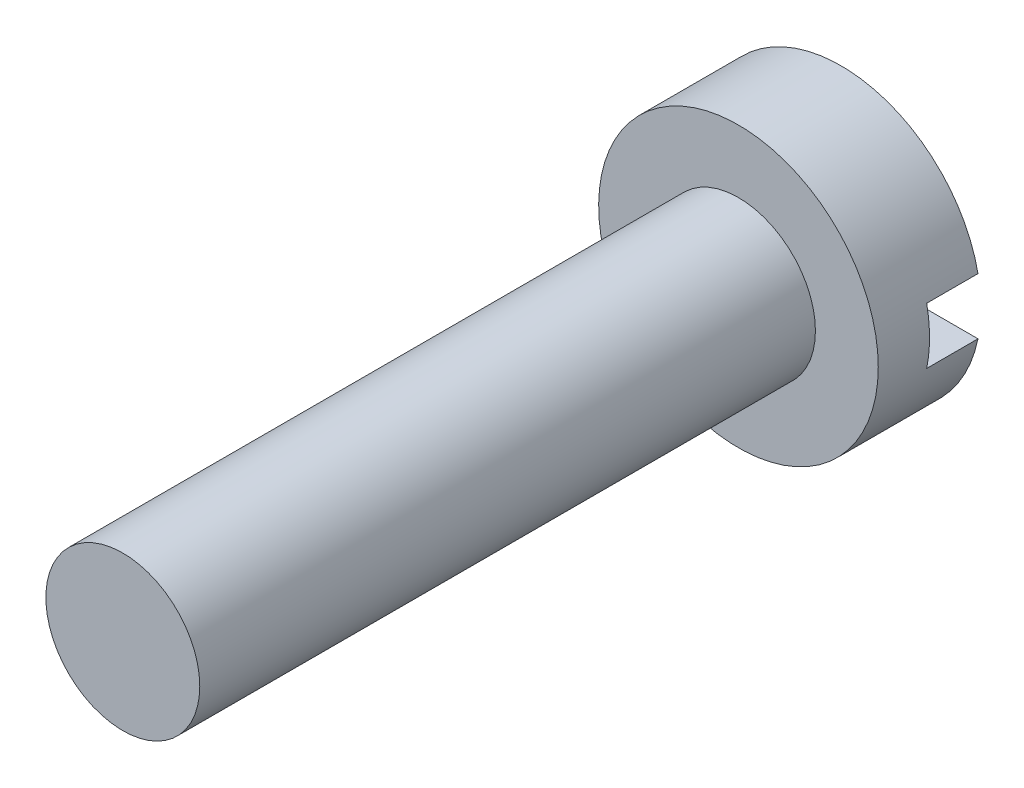
ISO-10303-21;
HEADER;
FILE_DESCRIPTION(('STEP AP214'),'2;1');
FILE_NAME('part.step','',(''),(''),'','','');
FILE_SCHEMA(('AUTOMOTIVE_DESIGN { 1 0 10303 214 1 1 1 1 }'));
ENDSEC;
DATA;
#1=APPLICATION_CONTEXT('core data for automotive mechanical design processes');
#2=APPLICATION_PROTOCOL_DEFINITION('international standard','automotive_design',2000,#1);
#3=PRODUCT_CONTEXT('',#1,'mechanical');
#4=PRODUCT('Part','Part','',(#3));
#5=PRODUCT_RELATED_PRODUCT_CATEGORY('part','',(#4));
#6=PRODUCT_DEFINITION_FORMATION('','',#4);
#7=PRODUCT_DEFINITION_CONTEXT('part definition',#1,'design');
#8=PRODUCT_DEFINITION('design','',#6,#7);
#9=PRODUCT_DEFINITION_SHAPE('','',#8);
#10=(LENGTH_UNIT() NAMED_UNIT(*) SI_UNIT(.MILLI.,.METRE.));
#11=(NAMED_UNIT(*) PLANE_ANGLE_UNIT() SI_UNIT($,.RADIAN.));
#12=(NAMED_UNIT(*) SI_UNIT($,.STERADIAN.) SOLID_ANGLE_UNIT());
#13=UNCERTAINTY_MEASURE_WITH_UNIT(LENGTH_MEASURE(1.E-05),#10,'distance_accuracy_value','');
#14=(GEOMETRIC_REPRESENTATION_CONTEXT(3) GLOBAL_UNCERTAINTY_ASSIGNED_CONTEXT((#13)) GLOBAL_UNIT_ASSIGNED_CONTEXT((#10,
#11,#12)) REPRESENTATION_CONTEXT('',''));
#15=CARTESIAN_POINT('',(0.,0.,0.));
#16=DIRECTION('',(0.,0.,1.));
#17=DIRECTION('',(1.,0.,0.));
#18=AXIS2_PLACEMENT_3D('',#15,#16,#17);
#19=CARTESIAN_POINT('',(0.,0.,2.));
#20=DIRECTION('',(0.,0.,1.));
#21=DIRECTION('',(1.,0.,0.));
#22=AXIS2_PLACEMENT_3D('',#19,#20,#21);
#23=PLANE('',#22);
#24=CARTESIAN_POINT('',(0.,0.,2.));
#25=DIRECTION('',(0.,0.,1.));
#26=DIRECTION('',(1.,0.,0.));
#27=AXIS2_PLACEMENT_3D('',#24,#25,#26);
#28=CIRCLE('',#27,2.725);
#29=CARTESIAN_POINT('',(2.725,0.,2.));
#30=VERTEX_POINT('',#29);
#31=EDGE_CURVE('E77',#30,#30,#28,.T.);
#32=ORIENTED_EDGE('',*,*,#31,.T.);
#33=EDGE_LOOP('',(#32));
#34=FACE_BOUND('',#33,.T.);
#35=CARTESIAN_POINT('',(0.,0.,2.));
#36=DIRECTION('',(0.,0.,1.));
#37=DIRECTION('',(1.,0.,0.));
#38=AXIS2_PLACEMENT_3D('',#35,#36,#37);
#39=CIRCLE('',#38,1.5);
#40=CARTESIAN_POINT('',(1.5,0.,2.));
#41=VERTEX_POINT('',#40);
#42=EDGE_CURVE('E143',#41,#41,#39,.T.);
#43=ORIENTED_EDGE('',*,*,#42,.F.);
#44=EDGE_LOOP('',(#43));
#45=FACE_BOUND('',#44,.T.);
#46=ADVANCED_FACE('F29',(#34,#45),#23,.T.);
#47=CARTESIAN_POINT('',(0.,0.,0.));
#48=DIRECTION('',(0.,0.,1.));
#49=DIRECTION('',(1.,0.,0.));
#50=AXIS2_PLACEMENT_3D('',#47,#48,#49);
#51=PLANE('',#50);
#52=CARTESIAN_POINT('',(0.,0.,0.));
#53=DIRECTION('',(0.,0.,1.));
#54=DIRECTION('',(1.,0.,0.));
#55=AXIS2_PLACEMENT_3D('',#52,#53,#54);
#56=CIRCLE('',#55,2.725);
#57=CARTESIAN_POINT('',(-2.66891832021889,-0.55,0.));
#58=VERTEX_POINT('',#57);
#59=CARTESIAN_POINT('',(2.66891832021889,-0.55,0.));
#60=VERTEX_POINT('',#59);
#61=EDGE_CURVE('E88',#58,#60,#56,.T.);
#62=ORIENTED_EDGE('',*,*,#61,.F.);
#63=DIRECTION('',(1.,0.,0.));
#64=VECTOR('',#63,1.);
#65=CARTESIAN_POINT('',(0.,-0.55,0.));
#66=LINE('',#65,#64);
#67=EDGE_CURVE('E76',#58,#60,#66,.T.);
#68=ORIENTED_EDGE('',*,*,#67,.T.);
#69=EDGE_LOOP('',(#62,#68));
#70=FACE_BOUND('',#69,.T.);
#71=ADVANCED_FACE('F106',(#70),#51,.F.);
#72=CARTESIAN_POINT('',(0.,0.,2.));
#73=DIRECTION('',(0.,0.,-1.));
#74=DIRECTION('',(-1.,0.,0.));
#75=AXIS2_PLACEMENT_3D('',#72,#73,#74);
#76=CYLINDRICAL_SURFACE('',#75,2.725);
#77=ORIENTED_EDGE('',*,*,#61,.T.);
#78=DIRECTION('',(0.,0.,-1.));
#79=VECTOR('',#78,1.);
#80=CARTESIAN_POINT('',(2.66891832021889,-0.55,2.));
#81=LINE('',#80,#79);
#82=CARTESIAN_POINT('',(2.66891832021889,-0.55,1.));
#83=VERTEX_POINT('',#82);
#84=EDGE_CURVE('E85',#60,#83,#81,.F.);
#85=ORIENTED_EDGE('',*,*,#84,.T.);
#86=CARTESIAN_POINT('',(0.,0.,1.));
#87=DIRECTION('',(0.,0.,-1.));
#88=DIRECTION('',(-1.,0.,0.));
#89=AXIS2_PLACEMENT_3D('',#86,#87,#88);
#90=CIRCLE('',#89,2.725);
#91=CARTESIAN_POINT('',(2.66891832021889,0.55,1.));
#92=VERTEX_POINT('',#91);
#93=EDGE_CURVE('E11',#92,#83,#90,.T.);
#94=ORIENTED_EDGE('',*,*,#93,.F.);
#95=DIRECTION('',(0.,0.,-1.));
#96=VECTOR('',#95,1.);
#97=CARTESIAN_POINT('',(2.66891832021889,0.55,2.));
#98=LINE('',#97,#96);
#99=CARTESIAN_POINT('',(2.66891832021889,0.55,0.));
#100=VERTEX_POINT('',#99);
#101=EDGE_CURVE('E71',#92,#100,#98,.T.);
#102=ORIENTED_EDGE('',*,*,#101,.T.);
#103=CARTESIAN_POINT('',(-2.66891832021889,0.55,0.));
#104=VERTEX_POINT('',#103);
#105=EDGE_CURVE('E83',#100,#104,#56,.T.);
#106=ORIENTED_EDGE('',*,*,#105,.T.);
#107=DIRECTION('',(0.,0.,-1.));
#108=VECTOR('',#107,1.);
#109=CARTESIAN_POINT('',(-2.66891832021889,0.55,2.));
#110=LINE('',#109,#108);
#111=CARTESIAN_POINT('',(-2.66891832021889,0.55,1.));
#112=VERTEX_POINT('',#111);
#113=EDGE_CURVE('E44',#104,#112,#110,.F.);
#114=ORIENTED_EDGE('',*,*,#113,.T.);
#115=CARTESIAN_POINT('',(-2.66891832021889,-0.55,1.));
#116=VERTEX_POINT('',#115);
#117=EDGE_CURVE('E33',#116,#112,#90,.T.);
#118=ORIENTED_EDGE('',*,*,#117,.F.);
#119=DIRECTION('',(0.,0.,-1.));
#120=VECTOR('',#119,1.);
#121=CARTESIAN_POINT('',(-2.66891832021889,-0.55,2.));
#122=LINE('',#121,#120);
#123=EDGE_CURVE('E52',#116,#58,#122,.T.);
#124=ORIENTED_EDGE('',*,*,#123,.T.);
#125=EDGE_LOOP('',(#77,#85,#94,#102,#106,#114,#118,#124));
#126=FACE_BOUND('',#125,.T.);
#127=ORIENTED_EDGE('',*,*,#31,.F.);
#128=EDGE_LOOP('',(#127));
#129=FACE_BOUND('',#128,.T.);
#130=ADVANCED_FACE('F31',(#126,#129),#76,.T.);
#131=ORIENTED_EDGE('',*,*,#105,.F.);
#132=DIRECTION('',(-1.,0.,0.));
#133=VECTOR('',#132,1.);
#134=CARTESIAN_POINT('',(0.,0.55,0.));
#135=LINE('',#134,#133);
#136=EDGE_CURVE('E68',#100,#104,#135,.T.);
#137=ORIENTED_EDGE('',*,*,#136,.T.);
#138=EDGE_LOOP('',(#131,#137));
#139=FACE_BOUND('',#138,.T.);
#140=ADVANCED_FACE('F87',(#139),#51,.F.);
#141=CARTESIAN_POINT('',(-3.44980190887808,0.55,1.));
#142=DIRECTION('',(0.,0.,-1.));
#143=DIRECTION('',(-1.,0.,0.));
#144=AXIS2_PLACEMENT_3D('',#141,#142,#143);
#145=PLANE('',#144);
#146=ORIENTED_EDGE('',*,*,#93,.T.);
#147=DIRECTION('',(-1.,0.,0.));
#148=VECTOR('',#147,1.);
#149=CARTESIAN_POINT('',(3.90126958400864,-0.55,1.));
#150=LINE('',#149,#148);
#151=EDGE_CURVE('E101',#83,#116,#150,.T.);
#152=ORIENTED_EDGE('',*,*,#151,.T.);
#153=ORIENTED_EDGE('',*,*,#117,.T.);
#154=DIRECTION('',(1.,0.,0.));
#155=VECTOR('',#154,1.);
#156=CARTESIAN_POINT('',(-3.44980190887808,0.55,1.));
#157=LINE('',#156,#155);
#158=EDGE_CURVE('E100',#112,#92,#157,.T.);
#159=ORIENTED_EDGE('',*,*,#158,.T.);
#160=EDGE_LOOP('',(#146,#152,#153,#159));
#161=FACE_BOUND('',#160,.T.);
#162=ADVANCED_FACE('F99',(#161),#145,.T.);
#163=CARTESIAN_POINT('',(3.90126958400864,-0.55,1.));
#164=DIRECTION('',(0.,-1.,0.));
#165=DIRECTION('',(0.,0.,-1.));
#166=AXIS2_PLACEMENT_3D('',#163,#164,#165);
#167=PLANE('',#166);
#168=ORIENTED_EDGE('',*,*,#151,.F.);
#169=ORIENTED_EDGE('',*,*,#84,.F.);
#170=ORIENTED_EDGE('',*,*,#67,.F.);
#171=ORIENTED_EDGE('',*,*,#123,.F.);
#172=EDGE_LOOP('',(#168,#169,#170,#171));
#173=FACE_BOUND('',#172,.T.);
#174=ADVANCED_FACE('F119',(#173),#167,.F.);
#175=CARTESIAN_POINT('',(-3.44980190887808,0.55,1.));
#176=DIRECTION('',(0.,1.,0.));
#177=DIRECTION('',(0.,0.,1.));
#178=AXIS2_PLACEMENT_3D('',#175,#176,#177);
#179=PLANE('',#178);
#180=ORIENTED_EDGE('',*,*,#158,.F.);
#181=ORIENTED_EDGE('',*,*,#113,.F.);
#182=ORIENTED_EDGE('',*,*,#136,.F.);
#183=ORIENTED_EDGE('',*,*,#101,.F.);
#184=EDGE_LOOP('',(#180,#181,#182,#183));
#185=FACE_BOUND('',#184,.T.);
#186=ADVANCED_FACE('F70',(#185),#179,.F.);
#187=CARTESIAN_POINT('',(0.,0.,14.));
#188=DIRECTION('',(0.,0.,-1.));
#189=DIRECTION('',(-1.,0.,0.));
#190=AXIS2_PLACEMENT_3D('',#187,#188,#189);
#191=CYLINDRICAL_SURFACE('',#190,1.5);
#192=CARTESIAN_POINT('',(0.,0.,14.));
#193=DIRECTION('',(0.,0.,1.));
#194=DIRECTION('',(1.,0.,0.));
#195=AXIS2_PLACEMENT_3D('',#192,#193,#194);
#196=CIRCLE('',#195,1.5);
#197=CARTESIAN_POINT('',(1.5,0.,14.));
#198=VERTEX_POINT('',#197);
#199=EDGE_CURVE('E102',#198,#198,#196,.T.);
#200=ORIENTED_EDGE('',*,*,#199,.F.);
#201=EDGE_LOOP('',(#200));
#202=FACE_BOUND('',#201,.T.);
#203=ORIENTED_EDGE('',*,*,#42,.T.);
#204=EDGE_LOOP('',(#203));
#205=FACE_BOUND('',#204,.T.);
#206=ADVANCED_FACE('F126',(#202,#205),#191,.T.);
#207=CARTESIAN_POINT('',(0.,0.,14.));
#208=DIRECTION('',(0.,0.,1.));
#209=DIRECTION('',(1.,0.,0.));
#210=AXIS2_PLACEMENT_3D('',#207,#208,#209);
#211=PLANE('',#210);
#212=ORIENTED_EDGE('',*,*,#199,.T.);
#213=EDGE_LOOP('',(#212));
#214=FACE_BOUND('',#213,.T.);
#215=ADVANCED_FACE('F132',(#214),#211,.T.);
#216=CLOSED_SHELL('',(#46,#71,#130,#140,#162,#174,#186,#206,#215));
#217=MANIFOLD_SOLID_BREP('B2',#216);
#218=ADVANCED_BREP_SHAPE_REPRESENTATION('',(#18,#217),#14);
#219=SHAPE_DEFINITION_REPRESENTATION(#9,#218);
ENDSEC;
END-ISO-10303-21;
